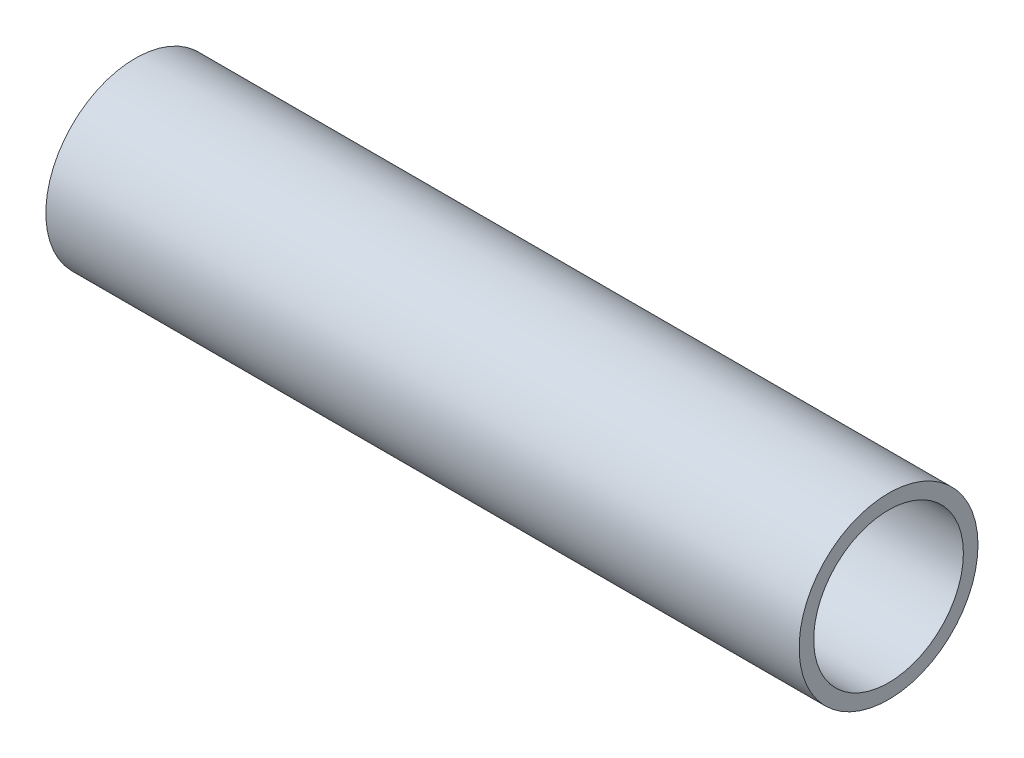
ISO-10303-21;
HEADER;
FILE_DESCRIPTION(('STEP AP214'),'2;1');
FILE_NAME('part.step','',(''),(''),'','','');
FILE_SCHEMA(('AUTOMOTIVE_DESIGN { 1 0 10303 214 1 1 1 1 }'));
ENDSEC;
DATA;
#1=APPLICATION_CONTEXT('core data for automotive mechanical design processes');
#2=APPLICATION_PROTOCOL_DEFINITION('international standard','automotive_design',2000,#1);
#3=PRODUCT_CONTEXT('',#1,'mechanical');
#4=PRODUCT('Part','Part','',(#3));
#5=PRODUCT_RELATED_PRODUCT_CATEGORY('part','',(#4));
#6=PRODUCT_DEFINITION_FORMATION('','',#4);
#7=PRODUCT_DEFINITION_CONTEXT('part definition',#1,'design');
#8=PRODUCT_DEFINITION('design','',#6,#7);
#9=PRODUCT_DEFINITION_SHAPE('','',#8);
#10=(LENGTH_UNIT() NAMED_UNIT(*) SI_UNIT(.MILLI.,.METRE.));
#11=(NAMED_UNIT(*) PLANE_ANGLE_UNIT() SI_UNIT($,.RADIAN.));
#12=(NAMED_UNIT(*) SI_UNIT($,.STERADIAN.) SOLID_ANGLE_UNIT());
#13=UNCERTAINTY_MEASURE_WITH_UNIT(LENGTH_MEASURE(1.E-05),#10,'distance_accuracy_value','');
#14=(GEOMETRIC_REPRESENTATION_CONTEXT(3) GLOBAL_UNCERTAINTY_ASSIGNED_CONTEXT((#13)) GLOBAL_UNIT_ASSIGNED_CONTEXT((#10,
#11,#12)) REPRESENTATION_CONTEXT('',''));
#15=CARTESIAN_POINT('',(0.,0.,0.));
#16=DIRECTION('',(0.,0.,1.));
#17=DIRECTION('',(1.,0.,0.));
#18=AXIS2_PLACEMENT_3D('',#15,#16,#17);
#19=CARTESIAN_POINT('',(203.2,0.,0.));
#20=DIRECTION('',(1.,0.,0.));
#21=DIRECTION('',(0.,0.,-1.));
#22=AXIS2_PLACEMENT_3D('',#19,#20,#21);
#23=PLANE('',#22);
#24=CARTESIAN_POINT('',(203.2,0.,0.));
#25=DIRECTION('',(1.,0.,0.));
#26=DIRECTION('',(0.,0.,-1.));
#27=AXIS2_PLACEMENT_3D('',#24,#25,#26);
#28=CIRCLE('',#27,24.13);
#29=CARTESIAN_POINT('',(203.2,0.,-24.13));
#30=VERTEX_POINT('',#29);
#31=EDGE_CURVE('E10',#30,#30,#28,.T.);
#32=ORIENTED_EDGE('',*,*,#31,.T.);
#33=EDGE_LOOP('',(#32));
#34=FACE_BOUND('',#33,.T.);
#35=CARTESIAN_POINT('',(203.2,0.,0.));
#36=DIRECTION('',(1.,0.,0.));
#37=DIRECTION('',(0.,0.,-1.));
#38=AXIS2_PLACEMENT_3D('',#35,#36,#37);
#39=CIRCLE('',#38,20.193);
#40=CARTESIAN_POINT('',(203.2,0.,-20.193));
#41=VERTEX_POINT('',#40);
#42=EDGE_CURVE('E41',#41,#41,#39,.T.);
#43=ORIENTED_EDGE('',*,*,#42,.F.);
#44=EDGE_LOOP('',(#43));
#45=FACE_BOUND('',#44,.T.);
#46=ADVANCED_FACE('F30',(#34,#45),#23,.T.);
#47=CARTESIAN_POINT('',(0.,0.,0.));
#48=DIRECTION('',(1.,0.,0.));
#49=DIRECTION('',(0.,0.,-1.));
#50=AXIS2_PLACEMENT_3D('',#47,#48,#49);
#51=PLANE('',#50);
#52=CARTESIAN_POINT('',(0.,0.,0.));
#53=DIRECTION('',(1.,0.,0.));
#54=DIRECTION('',(0.,0.,-1.));
#55=AXIS2_PLACEMENT_3D('',#52,#53,#54);
#56=CIRCLE('',#55,24.13);
#57=CARTESIAN_POINT('',(0.,0.,-24.13));
#58=VERTEX_POINT('',#57);
#59=EDGE_CURVE('E34',#58,#58,#56,.T.);
#60=ORIENTED_EDGE('',*,*,#59,.F.);
#61=EDGE_LOOP('',(#60));
#62=FACE_BOUND('',#61,.T.);
#63=CARTESIAN_POINT('',(0.,0.,0.));
#64=DIRECTION('',(1.,0.,0.));
#65=DIRECTION('',(0.,0.,-1.));
#66=AXIS2_PLACEMENT_3D('',#63,#64,#65);
#67=CIRCLE('',#66,20.193);
#68=CARTESIAN_POINT('',(0.,0.,-20.193));
#69=VERTEX_POINT('',#68);
#70=EDGE_CURVE('E43',#69,#69,#67,.T.);
#71=ORIENTED_EDGE('',*,*,#70,.T.);
#72=EDGE_LOOP('',(#71));
#73=FACE_BOUND('',#72,.T.);
#74=ADVANCED_FACE('F53',(#62,#73),#51,.F.);
#75=CARTESIAN_POINT('',(203.2,0.,0.));
#76=DIRECTION('',(-1.,0.,0.));
#77=DIRECTION('',(0.,0.,1.));
#78=AXIS2_PLACEMENT_3D('',#75,#76,#77);
#79=CYLINDRICAL_SURFACE('',#78,24.13);
#80=ORIENTED_EDGE('',*,*,#31,.F.);
#81=EDGE_LOOP('',(#80));
#82=FACE_BOUND('',#81,.T.);
#83=ORIENTED_EDGE('',*,*,#59,.T.);
#84=EDGE_LOOP('',(#83));
#85=FACE_BOUND('',#84,.T.);
#86=ADVANCED_FACE('F32',(#82,#85),#79,.T.);
#87=CARTESIAN_POINT('',(203.2,0.,0.));
#88=DIRECTION('',(-1.,0.,0.));
#89=DIRECTION('',(0.,0.,1.));
#90=AXIS2_PLACEMENT_3D('',#87,#88,#89);
#91=CYLINDRICAL_SURFACE('',#90,20.193);
#92=ORIENTED_EDGE('',*,*,#42,.T.);
#93=EDGE_LOOP('',(#92));
#94=FACE_BOUND('',#93,.T.);
#95=ORIENTED_EDGE('',*,*,#70,.F.);
#96=EDGE_LOOP('',(#95));
#97=FACE_BOUND('',#96,.T.);
#98=ADVANCED_FACE('F49',(#94,#97),#91,.F.);
#99=CLOSED_SHELL('',(#46,#74,#86,#98));
#100=MANIFOLD_SOLID_BREP('B2',#99);
#101=ADVANCED_BREP_SHAPE_REPRESENTATION('',(#18,#100),#14);
#102=SHAPE_DEFINITION_REPRESENTATION(#9,#101);
ENDSEC;
END-ISO-10303-21;
